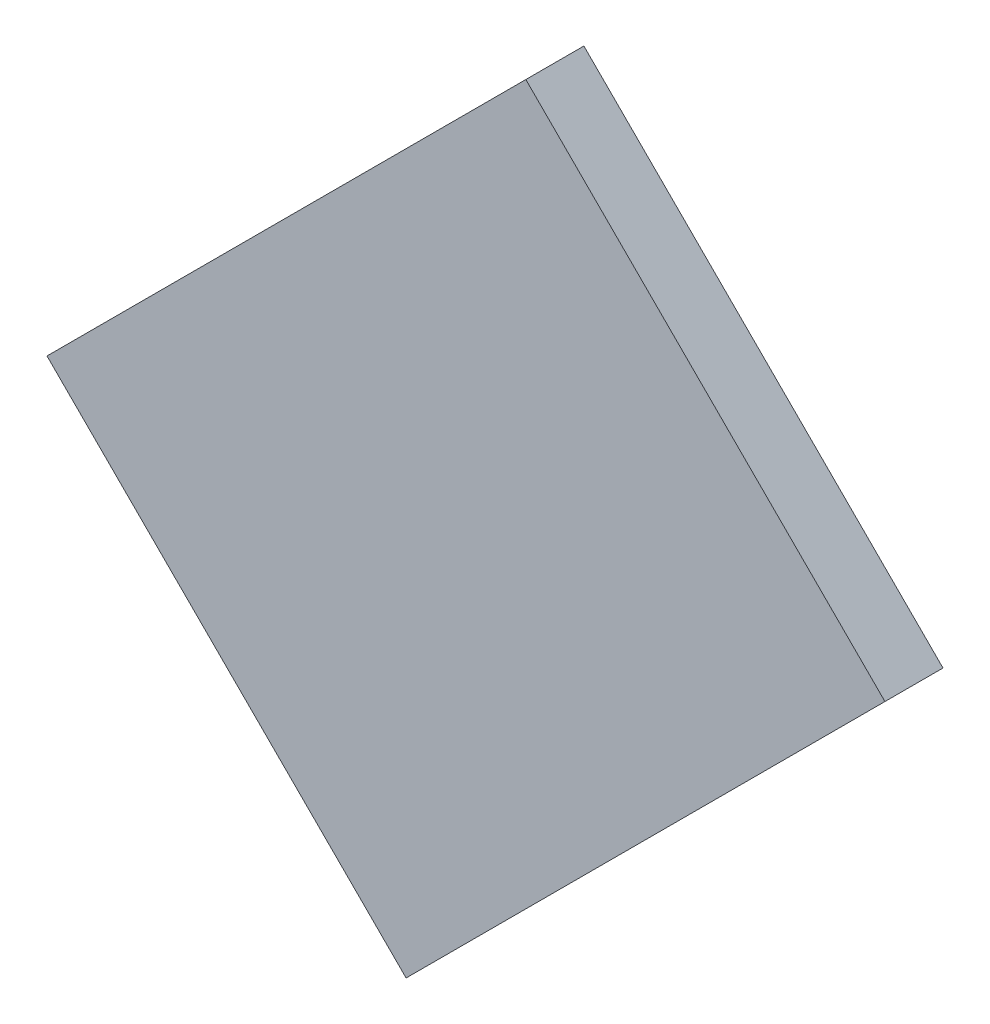
ISO-10303-21;
HEADER;
FILE_DESCRIPTION(('STEP AP214'),'2;1');
FILE_NAME('part.step','',(''),(''),'','','');
FILE_SCHEMA(('AUTOMOTIVE_DESIGN { 1 0 10303 214 1 1 1 1 }'));
ENDSEC;
DATA;
#1=APPLICATION_CONTEXT('core data for automotive mechanical design processes');
#2=APPLICATION_PROTOCOL_DEFINITION('international standard','automotive_design',2000,#1);
#3=PRODUCT_CONTEXT('',#1,'mechanical');
#4=PRODUCT('Part','Part','',(#3));
#5=PRODUCT_RELATED_PRODUCT_CATEGORY('part','',(#4));
#6=PRODUCT_DEFINITION_FORMATION('','',#4);
#7=PRODUCT_DEFINITION_CONTEXT('part definition',#1,'design');
#8=PRODUCT_DEFINITION('design','',#6,#7);
#9=PRODUCT_DEFINITION_SHAPE('','',#8);
#10=(LENGTH_UNIT() NAMED_UNIT(*) SI_UNIT(.MILLI.,.METRE.));
#11=(NAMED_UNIT(*) PLANE_ANGLE_UNIT() SI_UNIT($,.RADIAN.));
#12=(NAMED_UNIT(*) SI_UNIT($,.STERADIAN.) SOLID_ANGLE_UNIT());
#13=UNCERTAINTY_MEASURE_WITH_UNIT(LENGTH_MEASURE(1.E-05),#10,'distance_accuracy_value','');
#14=(GEOMETRIC_REPRESENTATION_CONTEXT(3) GLOBAL_UNCERTAINTY_ASSIGNED_CONTEXT((#13)) GLOBAL_UNIT_ASSIGNED_CONTEXT((#10,
#11,#12)) REPRESENTATION_CONTEXT('',''));
#15=CARTESIAN_POINT('',(0.,0.,0.));
#16=DIRECTION('',(0.,0.,1.));
#17=DIRECTION('',(1.,0.,0.));
#18=AXIS2_PLACEMENT_3D('',#15,#16,#17);
#19=CARTESIAN_POINT('',(4.1949546665,9.1654453335,0.76487));
#20=DIRECTION('',(0.,0.,-1.));
#21=DIRECTION('',(0.,1.,0.));
#22=AXIS2_PLACEMENT_3D('',#19,#20,#21);
#23=PLANE('',#22);
#24=DIRECTION('',(0.707106781186548,0.707106781186548,0.));
#25=VECTOR('',#24,1.);
#26=CARTESIAN_POINT('',(3.947467333,9.13009,0.76487));
#27=LINE('',#26,#25);
#28=CARTESIAN_POINT('',(3.947467333,9.13009,0.76487));
#29=VERTEX_POINT('',#28);
#30=CARTESIAN_POINT('',(4.23031,9.412932667,0.76487));
#31=VERTEX_POINT('',#30);
#32=EDGE_CURVE('E55',#29,#31,#27,.T.);
#33=ORIENTED_EDGE('',*,*,#32,.T.);
#34=DIRECTION('',(0.707106781186548,-0.707106781186548,0.));
#35=VECTOR('',#34,1.);
#36=CARTESIAN_POINT('',(4.23031,9.412932667,0.76487));
#37=LINE('',#36,#35);
#38=CARTESIAN_POINT('',(4.442442,9.200800667,0.76487));
#39=VERTEX_POINT('',#38);
#40=EDGE_CURVE('E57',#31,#39,#37,.T.);
#41=ORIENTED_EDGE('',*,*,#40,.T.);
#42=DIRECTION('',(-0.707106781186548,-0.707106781186548,0.));
#43=VECTOR('',#42,1.);
#44=CARTESIAN_POINT('',(4.442442,9.200800667,0.76487));
#45=LINE('',#44,#43);
#46=CARTESIAN_POINT('',(4.159599333,8.917958,0.76487));
#47=VERTEX_POINT('',#46);
#48=EDGE_CURVE('E20',#39,#47,#45,.T.);
#49=ORIENTED_EDGE('',*,*,#48,.T.);
#50=DIRECTION('',(-0.707106781186548,0.707106781186548,0.));
#51=VECTOR('',#50,1.);
#52=CARTESIAN_POINT('',(4.159599333,8.917958,0.76487));
#53=LINE('',#52,#51);
#54=EDGE_CURVE('E80',#47,#29,#53,.T.);
#55=ORIENTED_EDGE('',*,*,#54,.T.);
#56=EDGE_LOOP('',(#33,#41,#49,#55));
#57=FACE_BOUND('',#56,.T.);
#58=ADVANCED_FACE('F17',(#57),#23,.T.);
#59=CARTESIAN_POINT('',(4.442442,9.200800667,0.76487));
#60=DIRECTION('',(-0.707106781186548,0.707106781186548,0.));
#61=DIRECTION('',(-0.707106781186548,-0.707106781186548,0.));
#62=AXIS2_PLACEMENT_3D('',#59,#60,#61);
#63=PLANE('',#62);
#64=DIRECTION('',(0.,0.,1.));
#65=VECTOR('',#64,1.);
#66=CARTESIAN_POINT('',(4.159599333,8.917958,0.76487));
#67=LINE('',#66,#65);
#68=CARTESIAN_POINT('',(4.159599333,8.917958,0.79916));
#69=VERTEX_POINT('',#68);
#70=EDGE_CURVE('E68',#69,#47,#67,.F.);
#71=ORIENTED_EDGE('',*,*,#70,.T.);
#72=ORIENTED_EDGE('',*,*,#48,.F.);
#73=DIRECTION('',(0.,0.,1.));
#74=VECTOR('',#73,1.);
#75=CARTESIAN_POINT('',(4.442442,9.200800667,0.76487));
#76=LINE('',#75,#74);
#77=CARTESIAN_POINT('',(4.442442,9.200800667,0.79916));
#78=VERTEX_POINT('',#77);
#79=EDGE_CURVE('E63',#39,#78,#76,.T.);
#80=ORIENTED_EDGE('',*,*,#79,.T.);
#81=DIRECTION('',(0.707106781186549,0.707106781186547,0.));
#82=VECTOR('',#81,1.);
#83=CARTESIAN_POINT('',(4.159599333,8.917958,0.79916));
#84=LINE('',#83,#82);
#85=EDGE_CURVE('E83',#69,#78,#84,.T.);
#86=ORIENTED_EDGE('',*,*,#85,.F.);
#87=EDGE_LOOP('',(#71,#72,#80,#86));
#88=FACE_BOUND('',#87,.T.);
#89=ADVANCED_FACE('F65',(#88),#63,.F.);
#90=CARTESIAN_POINT('',(4.23031,9.412932667,0.76487));
#91=DIRECTION('',(-0.707106781186548,-0.707106781186548,0.));
#92=DIRECTION('',(0.707106781186548,-0.707106781186548,0.));
#93=AXIS2_PLACEMENT_3D('',#90,#91,#92);
#94=PLANE('',#93);
#95=ORIENTED_EDGE('',*,*,#79,.F.);
#96=ORIENTED_EDGE('',*,*,#40,.F.);
#97=DIRECTION('',(0.,0.,1.));
#98=VECTOR('',#97,1.);
#99=CARTESIAN_POINT('',(4.23031,9.412932667,0.76487));
#100=LINE('',#99,#98);
#101=CARTESIAN_POINT('',(4.23031,9.412932667,0.79916));
#102=VERTEX_POINT('',#101);
#103=EDGE_CURVE('E75',#31,#102,#100,.T.);
#104=ORIENTED_EDGE('',*,*,#103,.T.);
#105=DIRECTION('',(-0.707106781186546,0.707106781186549,0.));
#106=VECTOR('',#105,1.);
#107=CARTESIAN_POINT('',(4.442442,9.200800667,0.79916));
#108=LINE('',#107,#106);
#109=EDGE_CURVE('E72',#78,#102,#108,.T.);
#110=ORIENTED_EDGE('',*,*,#109,.F.);
#111=EDGE_LOOP('',(#95,#96,#104,#110));
#112=FACE_BOUND('',#111,.T.);
#113=ADVANCED_FACE('F70',(#112),#94,.F.);
#114=CARTESIAN_POINT('',(3.947467333,9.13009,0.76487));
#115=DIRECTION('',(0.707106781186548,-0.707106781186548,0.));
#116=DIRECTION('',(0.707106781186548,0.707106781186548,0.));
#117=AXIS2_PLACEMENT_3D('',#114,#115,#116);
#118=PLANE('',#117);
#119=ORIENTED_EDGE('',*,*,#103,.F.);
#120=ORIENTED_EDGE('',*,*,#32,.F.);
#121=DIRECTION('',(0.,0.,1.));
#122=VECTOR('',#121,1.);
#123=CARTESIAN_POINT('',(3.947467333,9.13009,0.76487));
#124=LINE('',#123,#122);
#125=CARTESIAN_POINT('',(3.947467333,9.13009,0.79916));
#126=VERTEX_POINT('',#125);
#127=EDGE_CURVE('E35',#29,#126,#124,.T.);
#128=ORIENTED_EDGE('',*,*,#127,.T.);
#129=DIRECTION('',(-0.707106781186546,-0.707106781186549,0.));
#130=VECTOR('',#129,1.);
#131=CARTESIAN_POINT('',(4.23031,9.412932667,0.79916));
#132=LINE('',#131,#130);
#133=EDGE_CURVE('E26',#102,#126,#132,.T.);
#134=ORIENTED_EDGE('',*,*,#133,.F.);
#135=EDGE_LOOP('',(#119,#120,#128,#134));
#136=FACE_BOUND('',#135,.T.);
#137=ADVANCED_FACE('F89',(#136),#118,.F.);
#138=CARTESIAN_POINT('',(4.159599333,8.917958,0.76487));
#139=DIRECTION('',(0.707106781186548,0.707106781186548,0.));
#140=DIRECTION('',(-0.707106781186548,0.707106781186548,0.));
#141=AXIS2_PLACEMENT_3D('',#138,#139,#140);
#142=PLANE('',#141);
#143=ORIENTED_EDGE('',*,*,#127,.F.);
#144=ORIENTED_EDGE('',*,*,#54,.F.);
#145=ORIENTED_EDGE('',*,*,#70,.F.);
#146=DIRECTION('',(0.707106781186549,-0.707106781186546,0.));
#147=VECTOR('',#146,1.);
#148=CARTESIAN_POINT('',(3.947467333,9.13009,0.79916));
#149=LINE('',#148,#147);
#150=EDGE_CURVE('E11',#126,#69,#149,.T.);
#151=ORIENTED_EDGE('',*,*,#150,.F.);
#152=EDGE_LOOP('',(#143,#144,#145,#151));
#153=FACE_BOUND('',#152,.T.);
#154=ADVANCED_FACE('F91',(#153),#142,.F.);
#155=CARTESIAN_POINT('',(4.1949546665,9.1654453335,0.79916));
#156=DIRECTION('',(0.,0.,1.));
#157=DIRECTION('',(0.,-1.,0.));
#158=AXIS2_PLACEMENT_3D('',#155,#156,#157);
#159=PLANE('',#158);
#160=ORIENTED_EDGE('',*,*,#133,.T.);
#161=ORIENTED_EDGE('',*,*,#150,.T.);
#162=ORIENTED_EDGE('',*,*,#85,.T.);
#163=ORIENTED_EDGE('',*,*,#109,.T.);
#164=EDGE_LOOP('',(#160,#161,#162,#163));
#165=FACE_BOUND('',#164,.T.);
#166=ADVANCED_FACE('F88',(#165),#159,.T.);
#167=CLOSED_SHELL('',(#58,#89,#113,#137,#154,#166));
#168=MANIFOLD_SOLID_BREP('B1',#167);
#169=ADVANCED_BREP_SHAPE_REPRESENTATION('',(#18,#168),#14);
#170=SHAPE_DEFINITION_REPRESENTATION(#9,#169);
ENDSEC;
END-ISO-10303-21;
